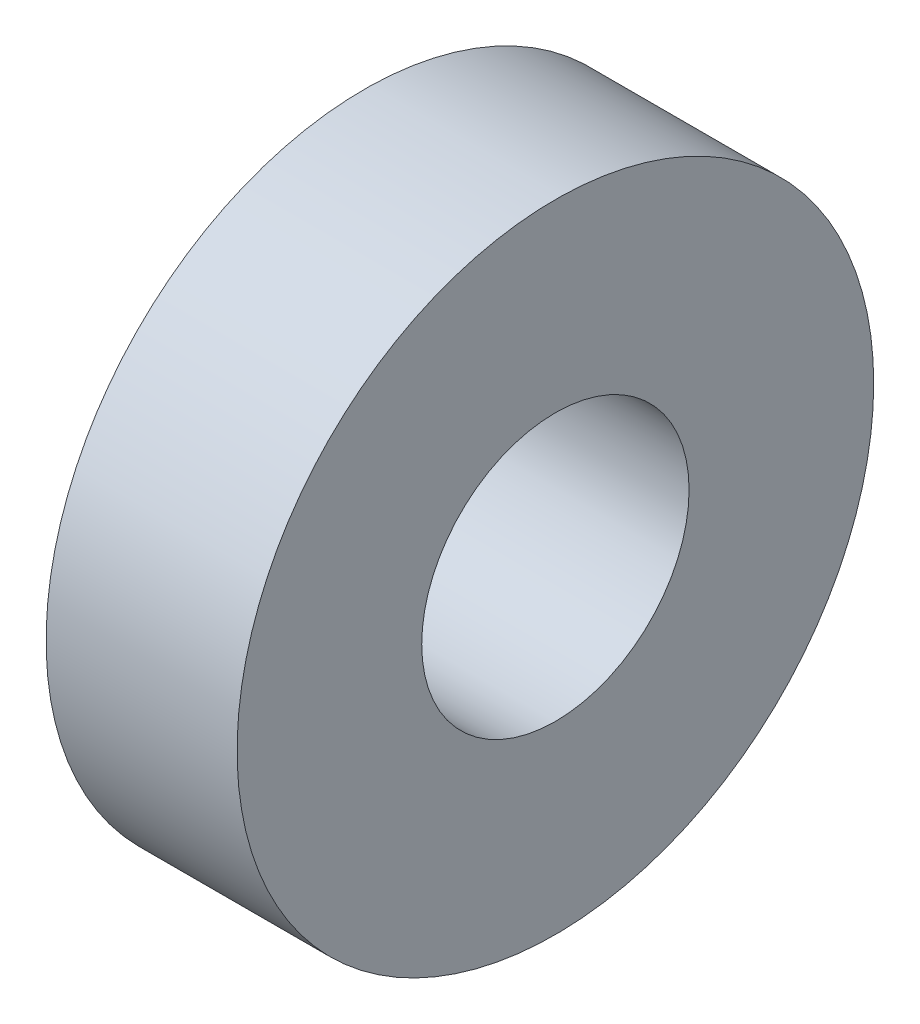
ISO-10303-21;
HEADER;
FILE_DESCRIPTION(('STEP AP214'),'2;1');
FILE_NAME('part.step','',(''),(''),'','','');
FILE_SCHEMA(('AUTOMOTIVE_DESIGN { 1 0 10303 214 1 1 1 1 }'));
ENDSEC;
DATA;
#1=APPLICATION_CONTEXT('core data for automotive mechanical design processes');
#2=APPLICATION_PROTOCOL_DEFINITION('international standard','automotive_design',2000,#1);
#3=PRODUCT_CONTEXT('',#1,'mechanical');
#4=PRODUCT('Part','Part','',(#3));
#5=PRODUCT_RELATED_PRODUCT_CATEGORY('part','',(#4));
#6=PRODUCT_DEFINITION_FORMATION('','',#4);
#7=PRODUCT_DEFINITION_CONTEXT('part definition',#1,'design');
#8=PRODUCT_DEFINITION('design','',#6,#7);
#9=PRODUCT_DEFINITION_SHAPE('','',#8);
#10=(LENGTH_UNIT() NAMED_UNIT(*) SI_UNIT(.MILLI.,.METRE.));
#11=(NAMED_UNIT(*) PLANE_ANGLE_UNIT() SI_UNIT($,.RADIAN.));
#12=(NAMED_UNIT(*) SI_UNIT($,.STERADIAN.) SOLID_ANGLE_UNIT());
#13=UNCERTAINTY_MEASURE_WITH_UNIT(LENGTH_MEASURE(1.E-05),#10,'distance_accuracy_value','');
#14=(GEOMETRIC_REPRESENTATION_CONTEXT(3) GLOBAL_UNCERTAINTY_ASSIGNED_CONTEXT((#13)) GLOBAL_UNIT_ASSIGNED_CONTEXT((#10,
#11,#12)) REPRESENTATION_CONTEXT('',''));
#15=CARTESIAN_POINT('',(0.,0.,0.));
#16=DIRECTION('',(0.,0.,1.));
#17=DIRECTION('',(1.,0.,0.));
#18=AXIS2_PLACEMENT_3D('',#15,#16,#17);
#19=CARTESIAN_POINT('',(3.,0.,0.));
#20=DIRECTION('',(1.,0.,0.));
#21=DIRECTION('',(0.,0.,-0.999999999999999));
#22=AXIS2_PLACEMENT_3D('',#19,#20,#21);
#23=PLANE('',#22);
#24=CARTESIAN_POINT('',(3.,0.,0.));
#25=DIRECTION('',(1.,0.,0.));
#26=DIRECTION('',(0.,0.,-0.999999999999999));
#27=AXIS2_PLACEMENT_3D('',#24,#25,#26);
#28=CIRCLE('',#27,5.);
#29=CARTESIAN_POINT('',(3.,0.,-4.99999999999999));
#30=VERTEX_POINT('',#29);
#31=EDGE_CURVE('E10',#30,#30,#28,.T.);
#32=ORIENTED_EDGE('',*,*,#31,.T.);
#33=EDGE_LOOP('',(#32));
#34=FACE_BOUND('',#33,.T.);
#35=CARTESIAN_POINT('',(3.,0.,0.));
#36=DIRECTION('',(1.,0.,0.));
#37=DIRECTION('',(0.,0.,-0.999999999999999));
#38=AXIS2_PLACEMENT_3D('',#35,#36,#37);
#39=CIRCLE('',#38,2.1);
#40=CARTESIAN_POINT('',(3.,0.,-2.1));
#41=VERTEX_POINT('',#40);
#42=EDGE_CURVE('E35',#41,#41,#39,.T.);
#43=ORIENTED_EDGE('',*,*,#42,.F.);
#44=EDGE_LOOP('',(#43));
#45=FACE_BOUND('',#44,.T.);
#46=ADVANCED_FACE('F24',(#34,#45),#23,.T.);
#47=CARTESIAN_POINT('',(0.,0.,0.));
#48=DIRECTION('',(1.,0.,0.));
#49=DIRECTION('',(0.,0.,-0.999999999999999));
#50=AXIS2_PLACEMENT_3D('',#47,#48,#49);
#51=PLANE('',#50);
#52=CARTESIAN_POINT('',(0.,0.,0.));
#53=DIRECTION('',(1.,0.,0.));
#54=DIRECTION('',(0.,0.,-0.999999999999999));
#55=AXIS2_PLACEMENT_3D('',#52,#53,#54);
#56=CIRCLE('',#55,5.);
#57=CARTESIAN_POINT('',(0.,0.,-4.99999999999999));
#58=VERTEX_POINT('',#57);
#59=EDGE_CURVE('E31',#58,#58,#56,.T.);
#60=ORIENTED_EDGE('',*,*,#59,.F.);
#61=EDGE_LOOP('',(#60));
#62=FACE_BOUND('',#61,.T.);
#63=CARTESIAN_POINT('',(0.,0.,0.));
#64=DIRECTION('',(1.,0.,0.));
#65=DIRECTION('',(0.,0.,-0.999999999999999));
#66=AXIS2_PLACEMENT_3D('',#63,#64,#65);
#67=CIRCLE('',#66,2.1);
#68=CARTESIAN_POINT('',(0.,0.,-2.1));
#69=VERTEX_POINT('',#68);
#70=EDGE_CURVE('E39',#69,#69,#67,.T.);
#71=ORIENTED_EDGE('',*,*,#70,.T.);
#72=EDGE_LOOP('',(#71));
#73=FACE_BOUND('',#72,.T.);
#74=ADVANCED_FACE('F45',(#62,#73),#51,.F.);
#75=CARTESIAN_POINT('',(3.,0.,0.));
#76=DIRECTION('',(-1.,0.,0.));
#77=DIRECTION('',(0.,0.,0.999999999999999));
#78=AXIS2_PLACEMENT_3D('',#75,#76,#77);
#79=CYLINDRICAL_SURFACE('',#78,5.);
#80=ORIENTED_EDGE('',*,*,#31,.F.);
#81=EDGE_LOOP('',(#80));
#82=FACE_BOUND('',#81,.T.);
#83=ORIENTED_EDGE('',*,*,#59,.T.);
#84=EDGE_LOOP('',(#83));
#85=FACE_BOUND('',#84,.T.);
#86=ADVANCED_FACE('F26',(#82,#85),#79,.T.);
#87=CARTESIAN_POINT('',(3.,0.,0.));
#88=DIRECTION('',(-1.,0.,0.));
#89=DIRECTION('',(0.,0.,0.999999999999999));
#90=AXIS2_PLACEMENT_3D('',#87,#88,#89);
#91=CYLINDRICAL_SURFACE('',#90,2.1);
#92=ORIENTED_EDGE('',*,*,#42,.T.);
#93=EDGE_LOOP('',(#92));
#94=FACE_BOUND('',#93,.T.);
#95=ORIENTED_EDGE('',*,*,#70,.F.);
#96=EDGE_LOOP('',(#95));
#97=FACE_BOUND('',#96,.T.);
#98=ADVANCED_FACE('F47',(#94,#97),#91,.F.);
#99=CLOSED_SHELL('',(#46,#74,#86,#98));
#100=MANIFOLD_SOLID_BREP('B2',#99);
#101=ADVANCED_BREP_SHAPE_REPRESENTATION('',(#18,#100),#14);
#102=SHAPE_DEFINITION_REPRESENTATION(#9,#101);
ENDSEC;
END-ISO-10303-21;
